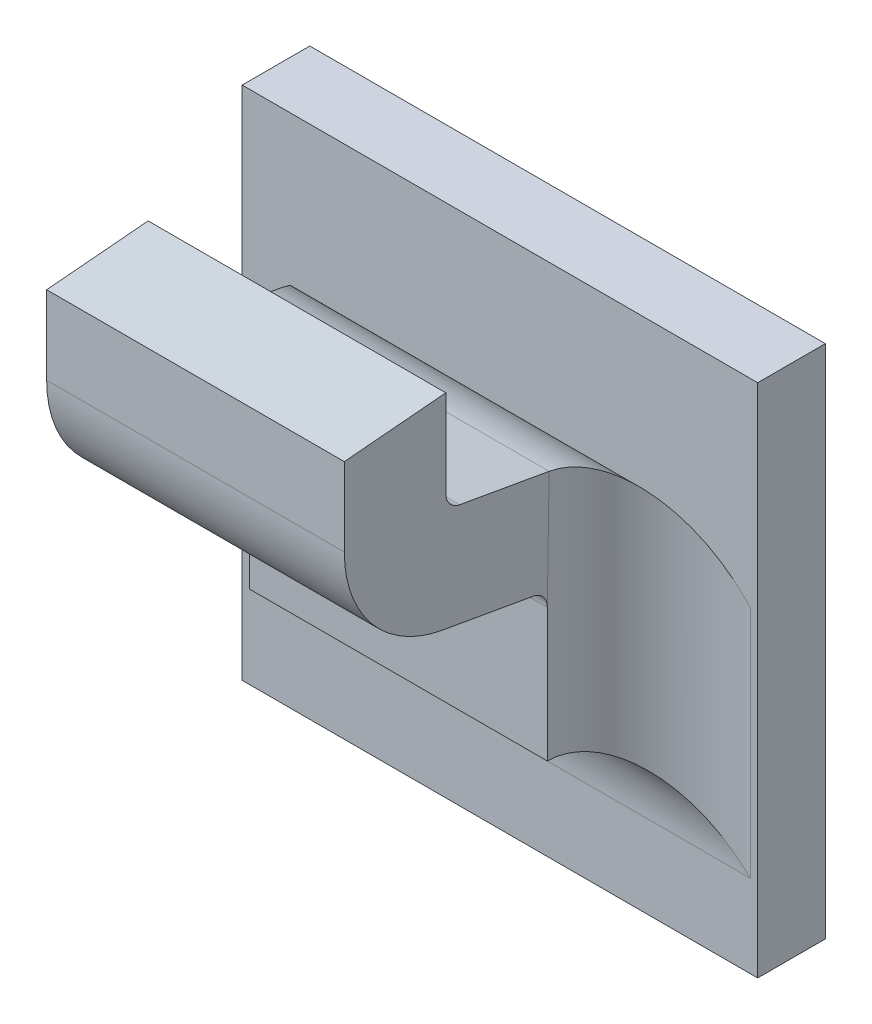
ISO-10303-21;
HEADER;
FILE_DESCRIPTION(('STEP AP214'),'2;1');
FILE_NAME('part.step','',(''),(''),'','','');
FILE_SCHEMA(('AUTOMOTIVE_DESIGN { 1 0 10303 214 1 1 1 1 }'));
ENDSEC;
DATA;
#1=APPLICATION_CONTEXT('core data for automotive mechanical design processes');
#2=APPLICATION_PROTOCOL_DEFINITION('international standard','automotive_design',2000,#1);
#3=PRODUCT_CONTEXT('',#1,'mechanical');
#4=PRODUCT('Part','Part','',(#3));
#5=PRODUCT_RELATED_PRODUCT_CATEGORY('part','',(#4));
#6=PRODUCT_DEFINITION_FORMATION('','',#4);
#7=PRODUCT_DEFINITION_CONTEXT('part definition',#1,'design');
#8=PRODUCT_DEFINITION('design','',#6,#7);
#9=PRODUCT_DEFINITION_SHAPE('','',#8);
#10=(LENGTH_UNIT() NAMED_UNIT(*) SI_UNIT(.MILLI.,.METRE.));
#11=(NAMED_UNIT(*) PLANE_ANGLE_UNIT() SI_UNIT($,.RADIAN.));
#12=(NAMED_UNIT(*) SI_UNIT($,.STERADIAN.) SOLID_ANGLE_UNIT());
#13=UNCERTAINTY_MEASURE_WITH_UNIT(LENGTH_MEASURE(1.E-05),#10,'distance_accuracy_value','');
#14=(GEOMETRIC_REPRESENTATION_CONTEXT(3) GLOBAL_UNCERTAINTY_ASSIGNED_CONTEXT((#13)) GLOBAL_UNIT_ASSIGNED_CONTEXT((#10,
#11,#12)) REPRESENTATION_CONTEXT('',''));
#15=CARTESIAN_POINT('',(0.,0.,0.));
#16=DIRECTION('',(0.,0.,1.));
#17=DIRECTION('',(1.,0.,0.));
#18=AXIS2_PLACEMENT_3D('',#15,#16,#17);
#19=CARTESIAN_POINT('',(-1.19388809134313,-0.481303520617574,0.0797273267071123));
#20=DIRECTION('',(1.,0.,0.));
#21=DIRECTION('',(0.,1.,0.));
#22=AXIS2_PLACEMENT_3D('',#19,#20,#21);
#23=CYLINDRICAL_SURFACE('',#22,0.00098425196850394);
#24=DIRECTION('',(1.,0.,0.));
#25=VECTOR('',#24,1.);
#26=CARTESIAN_POINT('',(-1.21294320945337,-0.481303520617574,0.0807115786756163));
#27=LINE('',#26,#25);
#28=CARTESIAN_POINT('',(-1.19475423307541,-0.481303520617574,0.0807115786756163));
#29=VERTEX_POINT('',#28);
#30=CARTESIAN_POINT('',(-1.21207706772108,-0.481303520617574,0.0807115786756163));
#31=VERTEX_POINT('',#30);
#32=EDGE_CURVE('E182',#29,#31,#27,.F.);
#33=ORIENTED_EDGE('',*,*,#32,.F.);
#34=CARTESIAN_POINT('',(-1.19475423307541,-0.481303520617574,0.0797273267071123));
#35=DIRECTION('',(1.,0.,0.));
#36=DIRECTION('',(0.,1.,0.));
#37=AXIS2_PLACEMENT_3D('',#34,#35,#36);
#38=CIRCLE('',#37,0.00098425196850394);
#39=CARTESIAN_POINT('',(-1.19475423307541,-0.482272819587074,0.0798982402678081));
#40=VERTEX_POINT('',#39);
#41=EDGE_CURVE('E155',#40,#29,#38,.F.);
#42=ORIENTED_EDGE('',*,*,#41,.F.);
#43=DIRECTION('',(1.,0.,0.));
#44=VECTOR('',#43,1.);
#45=CARTESIAN_POINT('',(-1.21294740223802,-0.482272819587074,0.0798982402678081));
#46=LINE('',#45,#44);
#47=CARTESIAN_POINT('',(-1.21207706772108,-0.482272819587074,0.0798982402678081));
#48=VERTEX_POINT('',#47);
#49=EDGE_CURVE('E137',#48,#40,#46,.T.);
#50=ORIENTED_EDGE('',*,*,#49,.F.);
#51=CARTESIAN_POINT('',(-1.21207706772108,-0.481303520617574,0.0797273267071123));
#52=DIRECTION('',(1.,0.,0.));
#53=DIRECTION('',(0.,1.,0.));
#54=AXIS2_PLACEMENT_3D('',#51,#52,#53);
#55=CIRCLE('',#54,0.00098425196850394);
#56=EDGE_CURVE('E148',#48,#31,#55,.F.);
#57=ORIENTED_EDGE('',*,*,#56,.T.);
#58=EDGE_LOOP('',(#33,#42,#50,#57));
#59=FACE_BOUND('',#58,.T.);
#60=ADVANCED_FACE('F17',(#59),#23,.F.);
#61=CARTESIAN_POINT('',(-1.21294320945337,-0.481557363411449,0.0807115786756163));
#62=DIRECTION('',(0.,0.,-1.));
#63=DIRECTION('',(0.,1.,0.));
#64=AXIS2_PLACEMENT_3D('',#61,#62,#63);
#65=PLANE('',#64);
#66=ORIENTED_EDGE('',*,*,#32,.T.);
#67=DIRECTION('',(0.,1.,0.));
#68=VECTOR('',#67,1.);
#69=CARTESIAN_POINT('',(-1.21207706772108,-0.490681533548079,0.0807115786756163));
#70=LINE('',#69,#68);
#71=CARTESIAN_POINT('',(-1.21207706772108,-0.476226664740066,0.0807115786756163));
#72=VERTEX_POINT('',#71);
#73=EDGE_CURVE('E177',#31,#72,#70,.T.);
#74=ORIENTED_EDGE('',*,*,#73,.T.);
#75=DIRECTION('',(1.,0.,0.));
#76=VECTOR('',#75,1.);
#77=CARTESIAN_POINT('',(-1.24091565039825,-0.476226664740067,0.0807115786756162));
#78=LINE('',#77,#76);
#79=CARTESIAN_POINT('',(-1.19475423307541,-0.476226664740066,0.0807115786756163));
#80=VERTEX_POINT('',#79);
#81=EDGE_CURVE('E170',#72,#80,#78,.T.);
#82=ORIENTED_EDGE('',*,*,#81,.T.);
#83=DIRECTION('',(0.,1.,0.));
#84=VECTOR('',#83,1.);
#85=CARTESIAN_POINT('',(-1.19475423307541,-0.490681533548079,0.0807115786756163));
#86=LINE('',#85,#84);
#87=EDGE_CURVE('E189',#29,#80,#86,.T.);
#88=ORIENTED_EDGE('',*,*,#87,.F.);
#89=EDGE_LOOP('',(#66,#74,#82,#88));
#90=FACE_BOUND('',#89,.T.);
#91=ADVANCED_FACE('F376',(#90),#65,.T.);
#92=CARTESIAN_POINT('',(-1.24091565039825,-0.476585262158006,0.0848103659183002));
#93=DIRECTION('',(0.,-0.996194698091746,-0.0871557427476516));
#94=DIRECTION('',(0.,0.0871557427476516,-0.996194698091746));
#95=AXIS2_PLACEMENT_3D('',#92,#93,#94);
#96=PLANE('',#95);
#97=DIRECTION('',(0.,-0.0871557427476615,0.996194698091745));
#98=VECTOR('',#97,1.);
#99=CARTESIAN_POINT('',(-1.19475423307541,-0.476226664740066,0.0807115786756163));
#100=LINE('',#99,#98);
#101=CARTESIAN_POINT('',(-1.19475423307541,-0.476743330075849,0.0866170904866399));
#102=VERTEX_POINT('',#101);
#103=EDGE_CURVE('E186',#80,#102,#100,.T.);
#104=ORIENTED_EDGE('',*,*,#103,.F.);
#105=ORIENTED_EDGE('',*,*,#81,.F.);
#106=DIRECTION('',(0.,-0.0871557427476615,0.996194698091745));
#107=VECTOR('',#106,1.);
#108=CARTESIAN_POINT('',(-1.21207706772108,-0.476226664740066,0.0807115786756163));
#109=LINE('',#108,#107);
#110=CARTESIAN_POINT('',(-1.21207706772108,-0.476743330075849,0.08661709048664));
#111=VERTEX_POINT('',#110);
#112=EDGE_CURVE('E173',#72,#111,#109,.T.);
#113=ORIENTED_EDGE('',*,*,#112,.T.);
#114=DIRECTION('',(1.,0.,0.));
#115=VECTOR('',#114,1.);
#116=CARTESIAN_POINT('',(-1.21294320945337,-0.476743330075849,0.0866170904866399));
#117=LINE('',#116,#115);
#118=EDGE_CURVE('E167',#111,#102,#117,.T.);
#119=ORIENTED_EDGE('',*,*,#118,.T.);
#120=EDGE_LOOP('',(#104,#105,#113,#119));
#121=FACE_BOUND('',#120,.T.);
#122=ADVANCED_FACE('F380',(#121),#96,.F.);
#123=CARTESIAN_POINT('',(-1.21294320945337,-0.48153153014466,0.0866170904866399));
#124=DIRECTION('',(0.,0.,-1.));
#125=DIRECTION('',(0.,1.,0.));
#126=AXIS2_PLACEMENT_3D('',#123,#124,#125);
#127=PLANE('',#126);
#128=ORIENTED_EDGE('',*,*,#118,.F.);
#129=DIRECTION('',(0.,1.,0.));
#130=VECTOR('',#129,1.);
#131=CARTESIAN_POINT('',(-1.21207706772108,-0.490681533548079,0.08661709048664));
#132=LINE('',#131,#130);
#133=CARTESIAN_POINT('',(-1.21207706772108,-0.481303520617574,0.0866170904866399));
#134=VERTEX_POINT('',#133);
#135=EDGE_CURVE('E176',#111,#134,#132,.F.);
#136=ORIENTED_EDGE('',*,*,#135,.T.);
#137=DIRECTION('',(1.,0.,0.));
#138=VECTOR('',#137,1.);
#139=CARTESIAN_POINT('',(-1.19388809134313,-0.481303520617574,0.0866170904866399));
#140=LINE('',#139,#138);
#141=CARTESIAN_POINT('',(-1.19475423307541,-0.481303520617574,0.0866170904866399));
#142=VERTEX_POINT('',#141);
#143=EDGE_CURVE('E165',#142,#134,#140,.F.);
#144=ORIENTED_EDGE('',*,*,#143,.F.);
#145=DIRECTION('',(0.,1.,0.));
#146=VECTOR('',#145,1.);
#147=CARTESIAN_POINT('',(-1.19475423307541,-0.490681533548079,0.08661709048664));
#148=LINE('',#147,#146);
#149=EDGE_CURVE('E188',#102,#142,#148,.F.);
#150=ORIENTED_EDGE('',*,*,#149,.F.);
#151=EDGE_LOOP('',(#128,#136,#144,#150));
#152=FACE_BOUND('',#151,.T.);
#153=ADVANCED_FACE('F384',(#152),#127,.F.);
#154=CARTESIAN_POINT('',(-1.19388809134313,-0.481303520617574,0.0797273267071123));
#155=DIRECTION('',(1.,0.,0.));
#156=DIRECTION('',(0.,1.,0.));
#157=AXIS2_PLACEMENT_3D('',#154,#155,#156);
#158=CYLINDRICAL_SURFACE('',#157,0.00688976377952756);
#159=CARTESIAN_POINT('',(-1.19475423307541,-0.481303520617574,0.0797273267071123));
#160=DIRECTION('',(1.,0.,0.));
#161=DIRECTION('',(0.,1.,0.));
#162=AXIS2_PLACEMENT_3D('',#159,#160,#161);
#163=CIRCLE('',#162,0.00688976377952756);
#164=CARTESIAN_POINT('',(-1.19475423307541,-0.488088613404075,0.0809237216319831));
#165=VERTEX_POINT('',#164);
#166=EDGE_CURVE('E146',#142,#165,#163,.T.);
#167=ORIENTED_EDGE('',*,*,#166,.F.);
#168=ORIENTED_EDGE('',*,*,#143,.T.);
#169=CARTESIAN_POINT('',(-1.21207706772108,-0.481303520617574,0.0797273267071123));
#170=DIRECTION('',(1.,0.,0.));
#171=DIRECTION('',(0.,1.,0.));
#172=AXIS2_PLACEMENT_3D('',#169,#170,#171);
#173=CIRCLE('',#172,0.00688976377952756);
#174=CARTESIAN_POINT('',(-1.21207706772108,-0.488088613404075,0.0809237216319831));
#175=VERTEX_POINT('',#174);
#176=EDGE_CURVE('E235',#134,#175,#173,.T.);
#177=ORIENTED_EDGE('',*,*,#176,.T.);
#178=DIRECTION('',(1.,0.,0.));
#179=VECTOR('',#178,1.);
#180=CARTESIAN_POINT('',(-1.21294320945337,-0.488088613404075,0.0809237216319829));
#181=LINE('',#180,#179);
#182=EDGE_CURVE('E138',#175,#165,#181,.T.);
#183=ORIENTED_EDGE('',*,*,#182,.T.);
#184=EDGE_LOOP('',(#167,#168,#177,#183));
#185=FACE_BOUND('',#184,.T.);
#186=ADVANCED_FACE('F388',(#185),#158,.T.);
#187=CARTESIAN_POINT('',(-1.21294320945337,-0.489070672196903,0.0753541894544217));
#188=DIRECTION('',(0.,0.984807753012208,-0.17364817766693));
#189=DIRECTION('',(0.,0.17364817766693,0.984807753012208));
#190=AXIS2_PLACEMENT_3D('',#187,#188,#189);
#191=PLANE('',#190);
#192=DIRECTION('',(1.,0.,0.));
#193=VECTOR('',#192,1.);
#194=CARTESIAN_POINT('',(-1.19388809134313,-0.489023907492483,0.0756194052724008));
#195=LINE('',#194,#193);
#196=CARTESIAN_POINT('',(-1.21207706772108,-0.489023907492483,0.0756194052724008));
#197=VERTEX_POINT('',#196);
#198=CARTESIAN_POINT('',(-1.19475423307541,-0.489023907492483,0.0756194052724008));
#199=VERTEX_POINT('',#198);
#200=EDGE_CURVE('E127',#197,#199,#195,.T.);
#201=ORIENTED_EDGE('',*,*,#200,.T.);
#202=DIRECTION('',(0.,-0.173648177666989,-0.984807753012198));
#203=VECTOR('',#202,1.);
#204=CARTESIAN_POINT('',(-1.19475423307541,-0.488088613404075,0.0809237216319829));
#205=LINE('',#204,#203);
#206=EDGE_CURVE('E130',#165,#199,#205,.T.);
#207=ORIENTED_EDGE('',*,*,#206,.F.);
#208=ORIENTED_EDGE('',*,*,#182,.F.);
#209=DIRECTION('',(0.,-0.173648177666989,-0.984807753012198));
#210=VECTOR('',#209,1.);
#211=CARTESIAN_POINT('',(-1.21207706772108,-0.488088613404075,0.0809237216319829));
#212=LINE('',#211,#210);
#213=EDGE_CURVE('E132',#175,#197,#212,.T.);
#214=ORIENTED_EDGE('',*,*,#213,.T.);
#215=EDGE_LOOP('',(#201,#207,#208,#214));
#216=FACE_BOUND('',#215,.T.);
#217=ADVANCED_FACE('F129',(#216),#191,.F.);
#218=CARTESIAN_POINT('',(-1.19388809134313,-0.489993206461983,0.0757903188330966));
#219=DIRECTION('',(1.,0.,0.));
#220=DIRECTION('',(0.,1.,0.));
#221=AXIS2_PLACEMENT_3D('',#218,#219,#220);
#222=CYLINDRICAL_SURFACE('',#221,0.00098425196850394);
#223=DIRECTION('',(1.,0.,0.));
#224=VECTOR('',#223,1.);
#225=CARTESIAN_POINT('',(-1.21294320945337,-0.489993206461983,0.0748060668645926));
#226=LINE('',#225,#224);
#227=CARTESIAN_POINT('',(-1.21207706772108,-0.489993206461983,0.0748060668645927));
#228=VERTEX_POINT('',#227);
#229=CARTESIAN_POINT('',(-1.19475423307541,-0.489993206461983,0.0748060668645926));
#230=VERTEX_POINT('',#229);
#231=EDGE_CURVE('E151',#228,#230,#226,.T.);
#232=ORIENTED_EDGE('',*,*,#231,.T.);
#233=CARTESIAN_POINT('',(-1.19475423307541,-0.489993206461983,0.0757903188330966));
#234=DIRECTION('',(1.,0.,0.));
#235=DIRECTION('',(0.,1.,0.));
#236=AXIS2_PLACEMENT_3D('',#233,#234,#235);
#237=CIRCLE('',#236,0.00098425196850394);
#238=EDGE_CURVE('E20',#199,#230,#237,.F.);
#239=ORIENTED_EDGE('',*,*,#238,.F.);
#240=ORIENTED_EDGE('',*,*,#200,.F.);
#241=CARTESIAN_POINT('',(-1.21207706772108,-0.489993206461983,0.0757903188330966));
#242=DIRECTION('',(1.,0.,0.));
#243=DIRECTION('',(0.,1.,0.));
#244=AXIS2_PLACEMENT_3D('',#241,#242,#243);
#245=CIRCLE('',#244,0.00098425196850394);
#246=EDGE_CURVE('E232',#197,#228,#245,.F.);
#247=ORIENTED_EDGE('',*,*,#246,.T.);
#248=EDGE_LOOP('',(#232,#239,#240,#247));
#249=FACE_BOUND('',#248,.T.);
#250=ADVANCED_FACE('F150',(#249),#222,.F.);
#251=CARTESIAN_POINT('',(-1.21294740223802,-0.483254878379902,0.0743287080902469));
#252=DIRECTION('',(0.,0.984807753012208,-0.17364817766693));
#253=DIRECTION('',(0.,0.17364817766693,0.984807753012208));
#254=AXIS2_PLACEMENT_3D('',#251,#252,#253);
#255=PLANE('',#254);
#256=DIRECTION('',(0.,0.173648177666938,0.984807753012207));
#257=VECTOR('',#256,1.);
#258=CARTESIAN_POINT('',(-1.19475423307541,-0.483170707148507,0.0748060668645927));
#259=LINE('',#258,#257);
#260=CARTESIAN_POINT('',(-1.19475232726421,-0.483189410411994,0.0746999953864093));
#261=VERTEX_POINT('',#260);
#262=EDGE_CURVE('E153',#261,#40,#259,.T.);
#263=ORIENTED_EDGE('',*,*,#262,.F.);
#264=DIRECTION('',(1.,0.,0.));
#265=VECTOR('',#264,1.);
#266=CARTESIAN_POINT('',(-1.187392028351,-0.483208113675482,0.0745939239082259));
#267=LINE('',#266,#265);
#268=CARTESIAN_POINT('',(-1.21207897353229,-0.483189410411994,0.0746999953864093));
#269=VERTEX_POINT('',#268);
#270=EDGE_CURVE('E264',#269,#261,#267,.T.);
#271=ORIENTED_EDGE('',*,*,#270,.F.);
#272=DIRECTION('',(0.,0.173648177666938,0.984807753012207));
#273=VECTOR('',#272,1.);
#274=CARTESIAN_POINT('',(-1.21207706772108,-0.483170707148507,0.0748060668645927));
#275=LINE('',#274,#273);
#276=EDGE_CURVE('E234',#269,#48,#275,.T.);
#277=ORIENTED_EDGE('',*,*,#276,.T.);
#278=ORIENTED_EDGE('',*,*,#49,.T.);
#279=EDGE_LOOP('',(#263,#271,#277,#278));
#280=FACE_BOUND('',#279,.T.);
#281=ADVANCED_FACE('F373',(#280),#255,.T.);
#282=CARTESIAN_POINT('',(-1.19475423307541,-0.490681533548079,0.0742155156834903));
#283=DIRECTION('',(1.,0.,0.));
#284=DIRECTION('',(0.,1.,0.));
#285=AXIS2_PLACEMENT_3D('',#282,#283,#284);
#286=PLANE('',#285);
#287=ORIENTED_EDGE('',*,*,#166,.T.);
#288=ORIENTED_EDGE('',*,*,#206,.T.);
#289=ORIENTED_EDGE('',*,*,#238,.T.);
#290=DIRECTION('',(0.,-1.,0.));
#291=VECTOR('',#290,1.);
#292=CARTESIAN_POINT('',(-1.19475423307541,-0.504665225306676,0.0748060668645926));
#293=LINE('',#292,#291);
#294=EDGE_CURVE('E271',#230,#261,#293,.F.);
#295=ORIENTED_EDGE('',*,*,#294,.T.);
#296=ORIENTED_EDGE('',*,*,#262,.T.);
#297=ORIENTED_EDGE('',*,*,#41,.T.);
#298=ORIENTED_EDGE('',*,*,#87,.T.);
#299=ORIENTED_EDGE('',*,*,#103,.T.);
#300=ORIENTED_EDGE('',*,*,#149,.T.);
#301=EDGE_LOOP('',(#287,#288,#289,#295,#296,#297,#298,#299,#300));
#302=FACE_BOUND('',#301,.T.);
#303=ADVANCED_FACE('F142',(#302),#286,.T.);
#304=CARTESIAN_POINT('',(-1.21207706772108,-0.490681533548079,0.0742155156834903));
#305=DIRECTION('',(1.,0.,0.));
#306=DIRECTION('',(0.,1.,0.));
#307=AXIS2_PLACEMENT_3D('',#304,#305,#306);
#308=PLANE('',#307);
#309=DIRECTION('',(0.,1.,0.));
#310=VECTOR('',#309,1.);
#311=CARTESIAN_POINT('',(-1.21207706772109,-0.482147158664785,0.0748060668645927));
#312=LINE('',#311,#310);
#313=EDGE_CURVE('E290',#269,#228,#312,.F.);
#314=ORIENTED_EDGE('',*,*,#313,.T.);
#315=ORIENTED_EDGE('',*,*,#246,.F.);
#316=ORIENTED_EDGE('',*,*,#213,.F.);
#317=ORIENTED_EDGE('',*,*,#176,.F.);
#318=ORIENTED_EDGE('',*,*,#135,.F.);
#319=ORIENTED_EDGE('',*,*,#112,.F.);
#320=ORIENTED_EDGE('',*,*,#73,.F.);
#321=ORIENTED_EDGE('',*,*,#56,.F.);
#322=ORIENTED_EDGE('',*,*,#276,.F.);
#323=EDGE_LOOP('',(#314,#315,#316,#317,#318,#319,#320,#321,#322));
#324=FACE_BOUND('',#323,.T.);
#325=ADVANCED_FACE('F371',(#324),#308,.F.);
#326=CARTESIAN_POINT('',(-1.21294320945337,-0.498123312939428,0.0748060668645926));
#327=DIRECTION('',(0.,0.,-1.));
#328=DIRECTION('',(0.,1.,0.));
#329=AXIS2_PLACEMENT_3D('',#326,#327,#328);
#330=PLANE('',#329);
#331=DIRECTION('',(-1.,0.,0.));
#332=VECTOR('',#331,1.);
#333=CARTESIAN_POINT('',(-1.24091565039825,-0.49773616501193,0.0748060668645926));
#334=LINE('',#333,#332);
#335=CARTESIAN_POINT('',(-1.21207706772109,-0.49773616501193,0.0748060668645926));
#336=VERTEX_POINT('',#335);
#337=CARTESIAN_POINT('',(-1.19475423307541,-0.49773616501193,0.0748060668645926));
#338=VERTEX_POINT('',#337);
#339=EDGE_CURVE('E275',#336,#338,#334,.F.);
#340=ORIENTED_EDGE('',*,*,#339,.T.);
#341=DIRECTION('',(0.,-1.,0.));
#342=VECTOR('',#341,1.);
#343=CARTESIAN_POINT('',(-1.19475423307541,-0.504665225306676,0.0748060668645926));
#344=LINE('',#343,#342);
#345=EDGE_CURVE('E268',#338,#230,#344,.F.);
#346=ORIENTED_EDGE('',*,*,#345,.T.);
#347=ORIENTED_EDGE('',*,*,#231,.F.);
#348=DIRECTION('',(0.,1.,0.));
#349=VECTOR('',#348,1.);
#350=CARTESIAN_POINT('',(-1.21207706772109,-0.482147158664785,0.0748060668645926));
#351=LINE('',#350,#349);
#352=EDGE_CURVE('E293',#228,#336,#351,.F.);
#353=ORIENTED_EDGE('',*,*,#352,.T.);
#354=EDGE_LOOP('',(#340,#346,#347,#353));
#355=FACE_BOUND('',#354,.T.);
#356=ADVANCED_FACE('F369',(#355),#330,.F.);
#357=CARTESIAN_POINT('',(-1.187392028351,-0.489993206461983,0.0757903188330966));
#358=DIRECTION('',(1.,0.,0.));
#359=DIRECTION('',(0.,1.,0.));
#360=AXIS2_PLACEMENT_3D('',#357,#358,#359);
#361=CYLINDRICAL_SURFACE('',#360,0.00688976377952756);
#362=ORIENTED_EDGE('',*,*,#270,.T.);
#363=CARTESIAN_POINT('',(-1.19475322709926,-0.483190299054108,0.0747001216257358));
#364=CARTESIAN_POINT('',(-1.1947483277511,-0.483237076502032,0.074405223433363));
#365=CARTESIAN_POINT('',(-1.19472072512036,-0.48330363441383,0.074115034151789));
#366=CARTESIAN_POINT('',(-1.19462678476824,-0.48347014964807,0.073553844729337));
#367=CARTESIAN_POINT('',(-1.19456081524893,-0.48356978567554,0.0732826892737776));
#368=CARTESIAN_POINT('',(-1.19439683153072,-0.483796900902092,0.0727646055784551));
#369=CARTESIAN_POINT('',(-1.19429895440614,-0.48392426023827,0.0725175794773051));
#370=CARTESIAN_POINT('',(-1.19407735294951,-0.484201625658181,0.0720485533086557));
#371=CARTESIAN_POINT('',(-1.19395356186493,-0.484351689945956,0.0718266201983145));
#372=CARTESIAN_POINT('',(-1.19361729390458,-0.484750708379493,0.0713022915327615));
#373=CARTESIAN_POINT('',(-1.19339184432977,-0.485010979657895,0.0710168133445037));
#374=CARTESIAN_POINT('',(-1.19290976770022,-0.485558615462719,0.0705040567027229));
#375=CARTESIAN_POINT('',(-1.19265306917862,-0.485846041744032,0.0702769154978245));
#376=CARTESIAN_POINT('',(-1.19201901897455,-0.486549705339456,0.0698026326616958));
#377=CARTESIAN_POINT('',(-1.19163243034505,-0.486973936440458,0.0695797433223628));
#378=CARTESIAN_POINT('',(-1.19083857417652,-0.487840056506252,0.0692289934880922));
#379=CARTESIAN_POINT('',(-1.19043132238154,-0.488281931974037,0.0691010617693635));
#380=CARTESIAN_POINT('',(-1.18974965449348,-0.489019814551546,0.0689631980798835));
#381=CARTESIAN_POINT('',(-1.18947777461357,-0.489313668588468,0.0689278051732856));
#382=CARTESIAN_POINT('',(-1.18908654119502,-0.4897363315112,0.0689041494171859));
#383=CARTESIAN_POINT('',(-1.18896762576773,-0.489864774668986,0.068900564537093));
#384=CARTESIAN_POINT('',(-1.18884872126439,-0.489993206461983,0.068900555053569));
#385=B_SPLINE_CURVE_WITH_KNOTS('',3,(#363,#364,#365,#366,#367,#368,#369,#370,#371,#372,#373,
#374,#375,#376,#377,#378,#379,#380,#381,#382,#383,#384),.UNSPECIFIED.,.F.,.F.,(4,2,2,2,2,2,2,2,
2,2,4),(0.,0.000892674275674751,0.00177691981761761,0.00265741564567005,0.00354020811045548,
0.00487460341316201,0.00621210995073985,0.00804949445936677,0.00988549942521251,
0.0110894312839999,0.0116145091100795),.UNSPECIFIED.);
#386=CARTESIAN_POINT('',(-1.18884872126439,-0.489993206461983,0.068900555053569));
#387=VERTEX_POINT('',#386);
#388=EDGE_CURVE('E231',#261,#387,#385,.T.);
#389=ORIENTED_EDGE('',*,*,#388,.T.);
#390=DIRECTION('',(1.,0.,0.));
#391=VECTOR('',#390,1.);
#392=CARTESIAN_POINT('',(-1.24091565039825,-0.489993206461983,0.068900555053569));
#393=LINE('',#392,#391);
#394=CARTESIAN_POINT('',(-1.21798257953211,-0.489993206461983,0.068900555053569));
#395=VERTEX_POINT('',#394);
#396=EDGE_CURVE('E195',#395,#387,#393,.T.);
#397=ORIENTED_EDGE('',*,*,#396,.F.);
#398=CARTESIAN_POINT('',(-1.21207807369723,-0.483190299054106,0.0747001216257356));
#399=CARTESIAN_POINT('',(-1.2120829730454,-0.483237076502032,0.0744052234333631));
#400=CARTESIAN_POINT('',(-1.21211057567614,-0.483303634413829,0.0741150341517891));
#401=CARTESIAN_POINT('',(-1.21220451602826,-0.48347014964807,0.0735538447293371));
#402=CARTESIAN_POINT('',(-1.21227048554757,-0.483569785675541,0.0732826892737776));
#403=CARTESIAN_POINT('',(-1.21243446926578,-0.483796900902092,0.0727646055784551));
#404=CARTESIAN_POINT('',(-1.21253234639036,-0.48392426023827,0.072517579477305));
#405=CARTESIAN_POINT('',(-1.21275394784699,-0.484201625658181,0.0720485533086556));
#406=CARTESIAN_POINT('',(-1.21287773893157,-0.484351689945956,0.0718266201983144));
#407=CARTESIAN_POINT('',(-1.21321400689192,-0.484750708379493,0.0713022915327614));
#408=CARTESIAN_POINT('',(-1.21343945646673,-0.485010979657895,0.0710168133445036));
#409=CARTESIAN_POINT('',(-1.21392153309628,-0.485558615462719,0.0705040567027228));
#410=CARTESIAN_POINT('',(-1.21417823161788,-0.485846041744032,0.0702769154978244));
#411=CARTESIAN_POINT('',(-1.21481228182195,-0.486549705339456,0.0698026326616957));
#412=CARTESIAN_POINT('',(-1.21519887045145,-0.486973936440458,0.0695797433223627));
#413=CARTESIAN_POINT('',(-1.21599272661998,-0.487840056506252,0.0692289934880922));
#414=CARTESIAN_POINT('',(-1.21639997841496,-0.488281931974038,0.0691010617693634));
#415=CARTESIAN_POINT('',(-1.21708164630302,-0.489019814551546,0.0689631980798835));
#416=CARTESIAN_POINT('',(-1.21735352618294,-0.489313668588467,0.0689278051732857));
#417=CARTESIAN_POINT('',(-1.21774475960148,-0.489736331511199,0.0689041494171859));
#418=CARTESIAN_POINT('',(-1.21786367502877,-0.489864774668985,0.0689005645370931));
#419=CARTESIAN_POINT('',(-1.21798257953211,-0.489993206461983,0.0689005550535691));
#420=B_SPLINE_CURVE_WITH_KNOTS('',3,(#398,#399,#400,#401,#402,#403,#404,#405,#406,#407,#408,
#409,#410,#411,#412,#413,#414,#415,#416,#417,#418,#419),.UNSPECIFIED.,.F.,.F.,(4,2,2,2,2,2,2,2,
2,2,4),(0.,0.000892674275674749,0.00177691981761785,0.0026574156456703,0.00354020811045573,
0.00487460341316246,0.00621210995074029,0.00804949445936743,0.0098854994252133,
0.0110894312840002,0.0116145091100797),.UNSPECIFIED.);
#421=EDGE_CURVE('E192',#395,#269,#420,.F.);
#422=ORIENTED_EDGE('',*,*,#421,.T.);
#423=EDGE_LOOP('',(#362,#389,#397,#422));
#424=FACE_BOUND('',#423,.T.);
#425=ADVANCED_FACE('F205',(#424),#361,.T.);
#426=CARTESIAN_POINT('',(-1.18884872126439,-0.504665225306676,0.0748060668645926));
#427=DIRECTION('',(0.,-1.,0.));
#428=DIRECTION('',(1.,0.,0.));
#429=AXIS2_PLACEMENT_3D('',#426,#427,#428);
#430=CYLINDRICAL_SURFACE('',#429,0.00590551181102362);
#431=ORIENTED_EDGE('',*,*,#345,.F.);
#432=CARTESIAN_POINT('',(-1.18884872126439,-0.503641676822954,0.0748060668645926));
#433=DIRECTION('',(-0.707106781186548,-0.707106781186547,0.));
#434=DIRECTION('',(0.707106781186547,-0.707106781186548,0.));
#435=AXIS2_PLACEMENT_3D('',#432,#433,#434);
#436=ELLIPSE('',#435,0.0083516548959041,0.00590551181102362);
#437=CARTESIAN_POINT('',(-1.18884872126439,-0.503641676822954,0.068900555053569));
#438=VERTEX_POINT('',#437);
#439=EDGE_CURVE('E281',#338,#438,#436,.T.);
#440=ORIENTED_EDGE('',*,*,#439,.T.);
#441=DIRECTION('',(0.,-1.,0.));
#442=VECTOR('',#441,1.);
#443=CARTESIAN_POINT('',(-1.18884872126439,-0.449184274957739,0.068900555053569));
#444=LINE('',#443,#442);
#445=EDGE_CURVE('E276',#387,#438,#444,.T.);
#446=ORIENTED_EDGE('',*,*,#445,.F.);
#447=ORIENTED_EDGE('',*,*,#388,.F.);
#448=ORIENTED_EDGE('',*,*,#294,.F.);
#449=EDGE_LOOP('',(#431,#440,#446,#447,#448));
#450=FACE_BOUND('',#449,.T.);
#451=ADVANCED_FACE('F219',(#450),#430,.F.);
#452=CARTESIAN_POINT('',(-1.24091565039825,-0.503641676822954,0.0748060668645926));
#453=DIRECTION('',(-1.,0.,0.));
#454=DIRECTION('',(0.,-1.,0.));
#455=AXIS2_PLACEMENT_3D('',#452,#453,#454);
#456=CYLINDRICAL_SURFACE('',#455,0.00590551181102362);
#457=DIRECTION('',(1.,0.,0.));
#458=VECTOR('',#457,1.);
#459=CARTESIAN_POINT('',(-1.24091565039825,-0.503641676822954,0.068900555053569));
#460=LINE('',#459,#458);
#461=CARTESIAN_POINT('',(-1.21798257953211,-0.503641676822954,0.068900555053569));
#462=VERTEX_POINT('',#461);
#463=EDGE_CURVE('E278',#438,#462,#460,.F.);
#464=ORIENTED_EDGE('',*,*,#463,.F.);
#465=ORIENTED_EDGE('',*,*,#439,.F.);
#466=ORIENTED_EDGE('',*,*,#339,.F.);
#467=CARTESIAN_POINT('',(-1.21798257953211,-0.503641676822954,0.0748060668645927));
#468=DIRECTION('',(-0.707106781186547,0.707106781186548,0.));
#469=DIRECTION('',(-0.707106781186548,-0.707106781186547,0.));
#470=AXIS2_PLACEMENT_3D('',#467,#468,#469);
#471=ELLIPSE('',#470,0.0083516548959041,0.00590551181102362);
#472=EDGE_CURVE('E196',#336,#462,#471,.T.);
#473=ORIENTED_EDGE('',*,*,#472,.T.);
#474=EDGE_LOOP('',(#464,#465,#466,#473));
#475=FACE_BOUND('',#474,.T.);
#476=ADVANCED_FACE('F215',(#475),#456,.F.);
#477=CARTESIAN_POINT('',(-1.21798257953211,-0.482147158664785,0.0748060668645927));
#478=DIRECTION('',(0.,1.,0.));
#479=DIRECTION('',(-1.,0.,0.));
#480=AXIS2_PLACEMENT_3D('',#477,#478,#479);
#481=CYLINDRICAL_SURFACE('',#480,0.00590551181102362);
#482=DIRECTION('',(0.,-1.,0.));
#483=VECTOR('',#482,1.);
#484=CARTESIAN_POINT('',(-1.21798257953211,-0.449184274957739,0.068900555053569));
#485=LINE('',#484,#483);
#486=EDGE_CURVE('E283',#462,#395,#485,.F.);
#487=ORIENTED_EDGE('',*,*,#486,.F.);
#488=ORIENTED_EDGE('',*,*,#472,.F.);
#489=ORIENTED_EDGE('',*,*,#352,.F.);
#490=ORIENTED_EDGE('',*,*,#313,.F.);
#491=ORIENTED_EDGE('',*,*,#421,.F.);
#492=EDGE_LOOP('',(#487,#488,#489,#490,#491));
#493=FACE_BOUND('',#492,.T.);
#494=ADVANCED_FACE('F209',(#493),#481,.F.);
#495=CARTESIAN_POINT('',(-1.24091565039825,-0.449184274957739,0.068900555053569));
#496=DIRECTION('',(0.,0.,1.));
#497=DIRECTION('',(0.,-1.,0.));
#498=AXIS2_PLACEMENT_3D('',#495,#496,#497);
#499=PLANE('',#498);
#500=ORIENTED_EDGE('',*,*,#463,.T.);
#501=ORIENTED_EDGE('',*,*,#486,.T.);
#502=ORIENTED_EDGE('',*,*,#396,.T.);
#503=ORIENTED_EDGE('',*,*,#445,.T.);
#504=EDGE_LOOP('',(#500,#501,#502,#503));
#505=FACE_BOUND('',#504,.T.);
#506=DIRECTION('',(0.,-1.,0.));
#507=VECTOR('',#506,1.);
#508=CARTESIAN_POINT('',(-1.18841565039825,-0.476955627617741,0.068900555053569));
#509=LINE('',#508,#507);
#510=CARTESIAN_POINT('',(-1.18841565039825,-0.508455627617741,0.068900555053569));
#511=VERTEX_POINT('',#510);
#512=CARTESIAN_POINT('',(-1.18841565039825,-0.478455627617741,0.068900555053569));
#513=VERTEX_POINT('',#512);
#514=EDGE_CURVE('E300',#511,#513,#509,.F.);
#515=ORIENTED_EDGE('',*,*,#514,.T.);
#516=DIRECTION('',(1.,0.,0.));
#517=VECTOR('',#516,1.);
#518=CARTESIAN_POINT('',(-1.21991565039825,-0.478455627617741,0.068900555053569));
#519=LINE('',#518,#517);
#520=CARTESIAN_POINT('',(-1.21841565039825,-0.478455627617741,0.068900555053569));
#521=VERTEX_POINT('',#520);
#522=EDGE_CURVE('E305',#513,#521,#519,.F.);
#523=ORIENTED_EDGE('',*,*,#522,.T.);
#524=DIRECTION('',(0.,1.,0.));
#525=VECTOR('',#524,1.);
#526=CARTESIAN_POINT('',(-1.21841565039825,-0.509955627617741,0.068900555053569));
#527=LINE('',#526,#525);
#528=CARTESIAN_POINT('',(-1.21841565039825,-0.508455627617741,0.068900555053569));
#529=VERTEX_POINT('',#528);
#530=EDGE_CURVE('E308',#521,#529,#527,.F.);
#531=ORIENTED_EDGE('',*,*,#530,.T.);
#532=DIRECTION('',(-1.,0.,0.));
#533=VECTOR('',#532,1.);
#534=CARTESIAN_POINT('',(-1.18691565039825,-0.508455627617741,0.068900555053569));
#535=LINE('',#534,#533);
#536=EDGE_CURVE('E286',#529,#511,#535,.F.);
#537=ORIENTED_EDGE('',*,*,#536,.T.);
#538=EDGE_LOOP('',(#515,#523,#531,#537));
#539=FACE_BOUND('',#538,.T.);
#540=ADVANCED_FACE('F214',(#505,#539),#499,.T.);
#541=CARTESIAN_POINT('',(-1.18691565039825,-0.508455627617741,0.0647666967858525));
#542=DIRECTION('',(0.,1.,0.));
#543=DIRECTION('',(-1.,0.,0.));
#544=AXIS2_PLACEMENT_3D('',#541,#542,#543);
#545=PLANE('',#544);
#546=DIRECTION('',(0.,0.,1.));
#547=VECTOR('',#546,1.);
#548=CARTESIAN_POINT('',(-1.18841565039825,-0.508455627617741,0.0647666967858525));
#549=LINE('',#548,#547);
#550=CARTESIAN_POINT('',(-1.18841565039825,-0.508455627617741,0.0649635471795533));
#551=VERTEX_POINT('',#550);
#552=EDGE_CURVE('E297',#551,#511,#549,.T.);
#553=ORIENTED_EDGE('',*,*,#552,.T.);
#554=ORIENTED_EDGE('',*,*,#536,.F.);
#555=DIRECTION('',(0.,0.,1.));
#556=VECTOR('',#555,1.);
#557=CARTESIAN_POINT('',(-1.21841565039825,-0.508455627617741,0.0647666967858525));
#558=LINE('',#557,#556);
#559=CARTESIAN_POINT('',(-1.21841565039825,-0.508455627617741,0.0649635471795533));
#560=VERTEX_POINT('',#559);
#561=EDGE_CURVE('E311',#529,#560,#558,.F.);
#562=ORIENTED_EDGE('',*,*,#561,.T.);
#563=DIRECTION('',(1.,0.,0.));
#564=VECTOR('',#563,1.);
#565=CARTESIAN_POINT('',(-1.24091565039825,-0.508455627617741,0.0649635471795533));
#566=LINE('',#565,#564);
#567=EDGE_CURVE('E314',#560,#551,#566,.T.);
#568=ORIENTED_EDGE('',*,*,#567,.T.);
#569=EDGE_LOOP('',(#553,#554,#562,#568));
#570=FACE_BOUND('',#569,.T.);
#571=ADVANCED_FACE('F332',(#570),#545,.F.);
#572=CARTESIAN_POINT('',(-1.18841565039825,-0.476955627617741,0.0647666967858525));
#573=DIRECTION('',(-1.,0.,0.));
#574=DIRECTION('',(0.,-1.,0.));
#575=AXIS2_PLACEMENT_3D('',#572,#573,#574);
#576=PLANE('',#575);
#577=DIRECTION('',(0.,0.,1.));
#578=VECTOR('',#577,1.);
#579=CARTESIAN_POINT('',(-1.18841565039825,-0.478455627617741,0.0647666967858525));
#580=LINE('',#579,#578);
#581=CARTESIAN_POINT('',(-1.18841565039825,-0.478455627617741,0.0649635471795533));
#582=VERTEX_POINT('',#581);
#583=EDGE_CURVE('E302',#582,#513,#580,.T.);
#584=ORIENTED_EDGE('',*,*,#583,.T.);
#585=ORIENTED_EDGE('',*,*,#514,.F.);
#586=ORIENTED_EDGE('',*,*,#552,.F.);
#587=DIRECTION('',(0.,-1.,0.));
#588=VECTOR('',#587,1.);
#589=CARTESIAN_POINT('',(-1.18841565039825,-0.449184274957739,0.0649635471795533));
#590=LINE('',#589,#588);
#591=EDGE_CURVE('E317',#551,#582,#590,.F.);
#592=ORIENTED_EDGE('',*,*,#591,.T.);
#593=EDGE_LOOP('',(#584,#585,#586,#592));
#594=FACE_BOUND('',#593,.T.);
#595=ADVANCED_FACE('F329',(#594),#576,.F.);
#596=CARTESIAN_POINT('',(-1.21991565039825,-0.478455627617741,0.0647666967858525));
#597=DIRECTION('',(0.,-1.,0.));
#598=DIRECTION('',(1.,0.,0.));
#599=AXIS2_PLACEMENT_3D('',#596,#597,#598);
#600=PLANE('',#599);
#601=DIRECTION('',(0.,0.,1.));
#602=VECTOR('',#601,1.);
#603=CARTESIAN_POINT('',(-1.21841565039825,-0.478455627617741,0.0647666967858525));
#604=LINE('',#603,#602);
#605=CARTESIAN_POINT('',(-1.21841565039825,-0.478455627617741,0.0649635471795533));
#606=VERTEX_POINT('',#605);
#607=EDGE_CURVE('E34',#606,#521,#604,.T.);
#608=ORIENTED_EDGE('',*,*,#607,.T.);
#609=ORIENTED_EDGE('',*,*,#522,.F.);
#610=ORIENTED_EDGE('',*,*,#583,.F.);
#611=DIRECTION('',(1.,0.,0.));
#612=VECTOR('',#611,1.);
#613=CARTESIAN_POINT('',(-1.24091565039825,-0.478455627617741,0.0649635471795533));
#614=LINE('',#613,#612);
#615=EDGE_CURVE('E26',#582,#606,#614,.F.);
#616=ORIENTED_EDGE('',*,*,#615,.T.);
#617=EDGE_LOOP('',(#608,#609,#610,#616));
#618=FACE_BOUND('',#617,.T.);
#619=ADVANCED_FACE('F323',(#618),#600,.F.);
#620=CARTESIAN_POINT('',(-1.21841565039825,-0.509955627617741,0.0647666967858525));
#621=DIRECTION('',(1.,0.,0.));
#622=DIRECTION('',(0.,1.,0.));
#623=AXIS2_PLACEMENT_3D('',#620,#621,#622);
#624=PLANE('',#623);
#625=ORIENTED_EDGE('',*,*,#561,.F.);
#626=ORIENTED_EDGE('',*,*,#530,.F.);
#627=ORIENTED_EDGE('',*,*,#607,.F.);
#628=DIRECTION('',(0.,-1.,0.));
#629=VECTOR('',#628,1.);
#630=CARTESIAN_POINT('',(-1.21841565039825,-0.449184274957739,0.0649635471795533));
#631=LINE('',#630,#629);
#632=EDGE_CURVE('E11',#606,#560,#631,.T.);
#633=ORIENTED_EDGE('',*,*,#632,.T.);
#634=EDGE_LOOP('',(#625,#626,#627,#633));
#635=FACE_BOUND('',#634,.T.);
#636=ADVANCED_FACE('F334',(#635),#624,.F.);
#637=CARTESIAN_POINT('',(-1.24091565039825,-0.449184274957739,0.0649635471795533));
#638=DIRECTION('',(0.,0.,1.));
#639=DIRECTION('',(0.,-1.,0.));
#640=AXIS2_PLACEMENT_3D('',#637,#638,#639);
#641=PLANE('',#640);
#642=ORIENTED_EDGE('',*,*,#615,.F.);
#643=ORIENTED_EDGE('',*,*,#591,.F.);
#644=ORIENTED_EDGE('',*,*,#567,.F.);
#645=ORIENTED_EDGE('',*,*,#632,.F.);
#646=EDGE_LOOP('',(#642,#643,#644,#645));
#647=FACE_BOUND('',#646,.T.);
#648=ADVANCED_FACE('F327',(#647),#641,.F.);
#649=CLOSED_SHELL('',(#60,#91,#122,#153,#186,#217,#250,#281,#303,#325,#356,#425,#451,#476,#494,
#540,#571,#595,#619,#636,#648));
#650=MANIFOLD_SOLID_BREP('B1',#649);
#651=ADVANCED_BREP_SHAPE_REPRESENTATION('',(#18,#650),#14);
#652=SHAPE_DEFINITION_REPRESENTATION(#9,#651);
ENDSEC;
END-ISO-10303-21;
